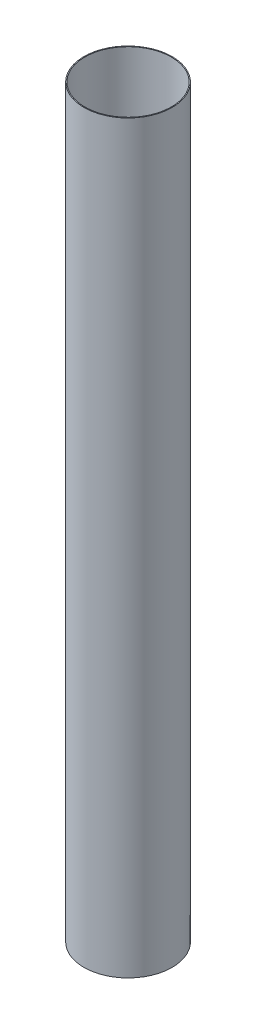
ISO-10303-21;
HEADER;
FILE_DESCRIPTION(('STEP AP214'),'2;1');
FILE_NAME('part.step','',(''),(''),'','','');
FILE_SCHEMA(('AUTOMOTIVE_DESIGN { 1 0 10303 214 1 1 1 1 }'));
ENDSEC;
DATA;
#1=APPLICATION_CONTEXT('core data for automotive mechanical design processes');
#2=APPLICATION_PROTOCOL_DEFINITION('international standard','automotive_design',2000,#1);
#3=PRODUCT_CONTEXT('',#1,'mechanical');
#4=PRODUCT('Part','Part','',(#3));
#5=PRODUCT_RELATED_PRODUCT_CATEGORY('part','',(#4));
#6=PRODUCT_DEFINITION_FORMATION('','',#4);
#7=PRODUCT_DEFINITION_CONTEXT('part definition',#1,'design');
#8=PRODUCT_DEFINITION('design','',#6,#7);
#9=PRODUCT_DEFINITION_SHAPE('','',#8);
#10=(LENGTH_UNIT() NAMED_UNIT(*) SI_UNIT(.MILLI.,.METRE.));
#11=(NAMED_UNIT(*) PLANE_ANGLE_UNIT() SI_UNIT($,.RADIAN.));
#12=(NAMED_UNIT(*) SI_UNIT($,.STERADIAN.) SOLID_ANGLE_UNIT());
#13=UNCERTAINTY_MEASURE_WITH_UNIT(LENGTH_MEASURE(1.E-05),#10,'distance_accuracy_value','');
#14=(GEOMETRIC_REPRESENTATION_CONTEXT(3) GLOBAL_UNCERTAINTY_ASSIGNED_CONTEXT((#13)) GLOBAL_UNIT_ASSIGNED_CONTEXT((#10,
#11,#12)) REPRESENTATION_CONTEXT('',''));
#15=CARTESIAN_POINT('',(0.,0.,0.));
#16=DIRECTION('',(0.,0.,1.));
#17=DIRECTION('',(1.,0.,0.));
#18=AXIS2_PLACEMENT_3D('',#15,#16,#17);
#19=CARTESIAN_POINT('',(0.,874.5982,0.));
#20=DIRECTION('',(0.,-1.,0.));
#21=DIRECTION('',(0.,0.,-1.));
#22=AXIS2_PLACEMENT_3D('',#19,#20,#21);
#23=CYLINDRICAL_SURFACE('',#22,50.8);
#24=CARTESIAN_POINT('',(0.,0.,0.));
#25=DIRECTION('',(0.,-1.,0.));
#26=DIRECTION('',(0.,0.,-1.));
#27=AXIS2_PLACEMENT_3D('',#24,#25,#26);
#28=CIRCLE('',#27,50.8);
#29=CARTESIAN_POINT('',(0.,0.,-50.8));
#30=VERTEX_POINT('',#29);
#31=EDGE_CURVE('E27',#30,#30,#28,.T.);
#32=ORIENTED_EDGE('',*,*,#31,.T.);
#33=EDGE_LOOP('',(#32));
#34=FACE_BOUND('',#33,.T.);
#35=CARTESIAN_POINT('',(0.,874.5982,0.));
#36=DIRECTION('',(0.,-1.,0.));
#37=DIRECTION('',(0.,0.,-1.));
#38=AXIS2_PLACEMENT_3D('',#35,#36,#37);
#39=CIRCLE('',#38,50.8);
#40=CARTESIAN_POINT('',(0.,874.5982,-50.8));
#41=VERTEX_POINT('',#40);
#42=EDGE_CURVE('E18',#41,#41,#39,.T.);
#43=ORIENTED_EDGE('',*,*,#42,.F.);
#44=EDGE_LOOP('',(#43));
#45=FACE_BOUND('',#44,.T.);
#46=ADVANCED_FACE('F15',(#34,#45),#23,.F.);
#47=CARTESIAN_POINT('',(0.,874.5982,0.));
#48=DIRECTION('',(0.,1.,0.));
#49=DIRECTION('',(0.,0.,1.));
#50=AXIS2_PLACEMENT_3D('',#47,#48,#49);
#51=PLANE('',#50);
#52=ORIENTED_EDGE('',*,*,#42,.T.);
#53=EDGE_LOOP('',(#52));
#54=FACE_BOUND('',#53,.T.);
#55=CARTESIAN_POINT('',(0.,874.5982,0.));
#56=DIRECTION('',(0.,-1.,0.));
#57=DIRECTION('',(0.,0.,-1.));
#58=AXIS2_PLACEMENT_3D('',#55,#56,#57);
#59=CIRCLE('',#58,51.816);
#60=CARTESIAN_POINT('',(0.,874.5982,-51.816));
#61=VERTEX_POINT('',#60);
#62=EDGE_CURVE('E22',#61,#61,#59,.T.);
#63=ORIENTED_EDGE('',*,*,#62,.F.);
#64=EDGE_LOOP('',(#63));
#65=FACE_BOUND('',#64,.T.);
#66=ADVANCED_FACE('F35',(#54,#65),#51,.T.);
#67=CARTESIAN_POINT('',(0.,0.,0.));
#68=DIRECTION('',(0.,1.,0.));
#69=DIRECTION('',(0.,0.,1.));
#70=AXIS2_PLACEMENT_3D('',#67,#68,#69);
#71=PLANE('',#70);
#72=ORIENTED_EDGE('',*,*,#31,.F.);
#73=EDGE_LOOP('',(#72));
#74=FACE_BOUND('',#73,.T.);
#75=CARTESIAN_POINT('',(0.,0.,0.));
#76=DIRECTION('',(0.,-1.,0.));
#77=DIRECTION('',(0.,0.,-1.));
#78=AXIS2_PLACEMENT_3D('',#75,#76,#77);
#79=CIRCLE('',#78,51.816);
#80=CARTESIAN_POINT('',(0.,0.,-51.816));
#81=VERTEX_POINT('',#80);
#82=EDGE_CURVE('E10',#81,#81,#79,.F.);
#83=ORIENTED_EDGE('',*,*,#82,.F.);
#84=EDGE_LOOP('',(#83));
#85=FACE_BOUND('',#84,.T.);
#86=ADVANCED_FACE('F43',(#74,#85),#71,.F.);
#87=CARTESIAN_POINT('',(0.,874.5982,0.));
#88=DIRECTION('',(0.,-1.,0.));
#89=DIRECTION('',(0.,0.,-1.));
#90=AXIS2_PLACEMENT_3D('',#87,#88,#89);
#91=CYLINDRICAL_SURFACE('',#90,51.816);
#92=ORIENTED_EDGE('',*,*,#82,.T.);
#93=EDGE_LOOP('',(#92));
#94=FACE_BOUND('',#93,.T.);
#95=ORIENTED_EDGE('',*,*,#62,.T.);
#96=EDGE_LOOP('',(#95));
#97=FACE_BOUND('',#96,.T.);
#98=ADVANCED_FACE('F44',(#94,#97),#91,.T.);
#99=CLOSED_SHELL('',(#46,#66,#86,#98));
#100=MANIFOLD_SOLID_BREP('B1',#99);
#101=ADVANCED_BREP_SHAPE_REPRESENTATION('',(#18,#100),#14);
#102=SHAPE_DEFINITION_REPRESENTATION(#9,#101);
ENDSEC;
END-ISO-10303-21;
